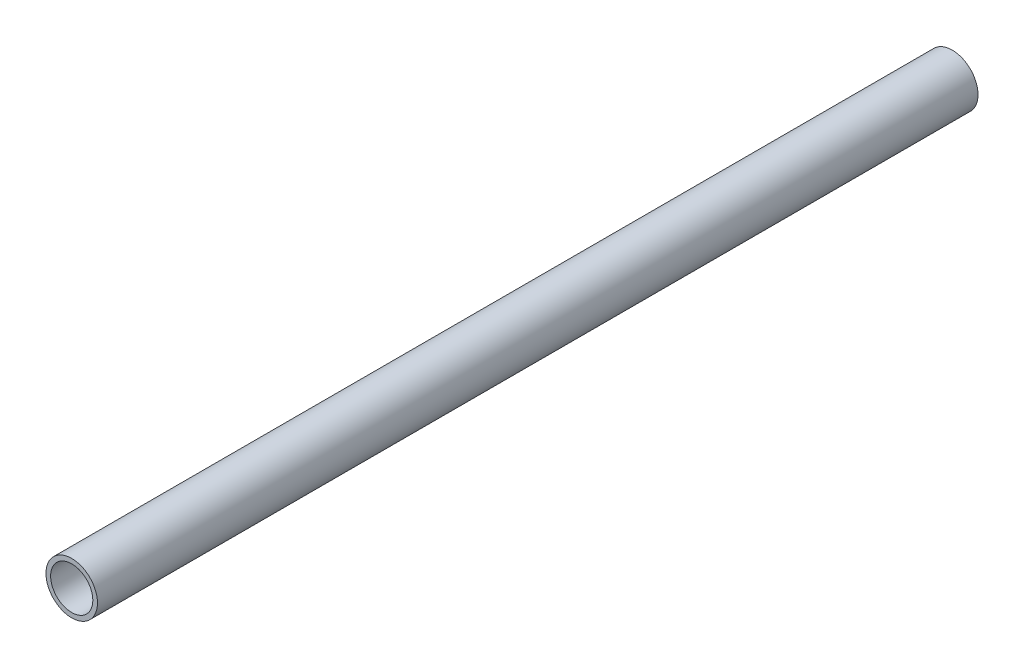
ISO-10303-21;
HEADER;
FILE_DESCRIPTION(('STEP AP214'),'2;1');
FILE_NAME('part.step','',(''),(''),'','','');
FILE_SCHEMA(('AUTOMOTIVE_DESIGN { 1 0 10303 214 1 1 1 1 }'));
ENDSEC;
DATA;
#1=APPLICATION_CONTEXT('core data for automotive mechanical design processes');
#2=APPLICATION_PROTOCOL_DEFINITION('international standard','automotive_design',2000,#1);
#3=PRODUCT_CONTEXT('',#1,'mechanical');
#4=PRODUCT('Part','Part','',(#3));
#5=PRODUCT_RELATED_PRODUCT_CATEGORY('part','',(#4));
#6=PRODUCT_DEFINITION_FORMATION('','',#4);
#7=PRODUCT_DEFINITION_CONTEXT('part definition',#1,'design');
#8=PRODUCT_DEFINITION('design','',#6,#7);
#9=PRODUCT_DEFINITION_SHAPE('','',#8);
#10=(LENGTH_UNIT() NAMED_UNIT(*) SI_UNIT(.MILLI.,.METRE.));
#11=(NAMED_UNIT(*) PLANE_ANGLE_UNIT() SI_UNIT($,.RADIAN.));
#12=(NAMED_UNIT(*) SI_UNIT($,.STERADIAN.) SOLID_ANGLE_UNIT());
#13=UNCERTAINTY_MEASURE_WITH_UNIT(LENGTH_MEASURE(1.E-05),#10,'distance_accuracy_value','');
#14=(GEOMETRIC_REPRESENTATION_CONTEXT(3) GLOBAL_UNCERTAINTY_ASSIGNED_CONTEXT((#13)) GLOBAL_UNIT_ASSIGNED_CONTEXT((#10,
#11,#12)) REPRESENTATION_CONTEXT('',''));
#15=CARTESIAN_POINT('',(0.,0.,0.));
#16=DIRECTION('',(0.,0.,1.));
#17=DIRECTION('',(1.,0.,0.));
#18=AXIS2_PLACEMENT_3D('',#15,#16,#17);
#19=CARTESIAN_POINT('',(0.,0.,-45.2043070672369));
#20=DIRECTION('',(0.,0.,1.));
#21=DIRECTION('',(1.,0.,0.));
#22=AXIS2_PLACEMENT_3D('',#19,#20,#21);
#23=CYLINDRICAL_SURFACE('',#22,7.75);
#24=CARTESIAN_POINT('',(0.,0.,-45.2043070672369));
#25=DIRECTION('',(0.,0.,1.));
#26=DIRECTION('',(1.,0.,0.));
#27=AXIS2_PLACEMENT_3D('',#24,#25,#26);
#28=CIRCLE('',#27,7.75);
#29=CARTESIAN_POINT('',(7.75,0.,-45.2043070672369));
#30=VERTEX_POINT('',#29);
#31=EDGE_CURVE('E10',#30,#30,#28,.T.);
#32=ORIENTED_EDGE('',*,*,#31,.T.);
#33=EDGE_LOOP('',(#32));
#34=FACE_BOUND('',#33,.T.);
#35=CARTESIAN_POINT('',(0.,0.,219.716847890713));
#36=DIRECTION('',(0.,0.,1.));
#37=DIRECTION('',(1.,0.,0.));
#38=AXIS2_PLACEMENT_3D('',#35,#36,#37);
#39=CIRCLE('',#38,7.75);
#40=CARTESIAN_POINT('',(7.75,0.,219.716847890713));
#41=VERTEX_POINT('',#40);
#42=EDGE_CURVE('E42',#41,#41,#39,.T.);
#43=ORIENTED_EDGE('',*,*,#42,.F.);
#44=EDGE_LOOP('',(#43));
#45=FACE_BOUND('',#44,.T.);
#46=ADVANCED_FACE('F32',(#34,#45),#23,.T.);
#47=CARTESIAN_POINT('',(0.,0.,-45.2043070672369));
#48=DIRECTION('',(0.,0.,1.));
#49=DIRECTION('',(1.,0.,0.));
#50=AXIS2_PLACEMENT_3D('',#47,#48,#49);
#51=PLANE('',#50);
#52=CARTESIAN_POINT('',(0.,0.,-45.2043070672369));
#53=DIRECTION('',(0.,0.,1.));
#54=DIRECTION('',(1.,0.,0.));
#55=AXIS2_PLACEMENT_3D('',#52,#53,#54);
#56=CIRCLE('',#55,6.35);
#57=CARTESIAN_POINT('',(6.35,0.,-45.2043070672369));
#58=VERTEX_POINT('',#57);
#59=EDGE_CURVE('E38',#58,#58,#56,.T.);
#60=ORIENTED_EDGE('',*,*,#59,.T.);
#61=EDGE_LOOP('',(#60));
#62=FACE_BOUND('',#61,.T.);
#63=ORIENTED_EDGE('',*,*,#31,.F.);
#64=EDGE_LOOP('',(#63));
#65=FACE_BOUND('',#64,.T.);
#66=ADVANCED_FACE('F61',(#62,#65),#51,.F.);
#67=CARTESIAN_POINT('',(0.,0.,-45.2043070672369));
#68=DIRECTION('',(0.,0.,1.));
#69=DIRECTION('',(1.,0.,0.));
#70=AXIS2_PLACEMENT_3D('',#67,#68,#69);
#71=CYLINDRICAL_SURFACE('',#70,6.35);
#72=ORIENTED_EDGE('',*,*,#59,.F.);
#73=EDGE_LOOP('',(#72));
#74=FACE_BOUND('',#73,.T.);
#75=CARTESIAN_POINT('',(0.,0.,219.716847890713));
#76=DIRECTION('',(0.,0.,1.));
#77=DIRECTION('',(1.,0.,0.));
#78=AXIS2_PLACEMENT_3D('',#75,#76,#77);
#79=CIRCLE('',#78,6.35);
#80=CARTESIAN_POINT('',(6.35,0.,219.716847890713));
#81=VERTEX_POINT('',#80);
#82=EDGE_CURVE('E46',#81,#81,#79,.T.);
#83=ORIENTED_EDGE('',*,*,#82,.T.);
#84=EDGE_LOOP('',(#83));
#85=FACE_BOUND('',#84,.T.);
#86=ADVANCED_FACE('F52',(#74,#85),#71,.F.);
#87=CARTESIAN_POINT('',(0.,0.,219.716847890713));
#88=DIRECTION('',(0.,0.,1.));
#89=DIRECTION('',(1.,0.,0.));
#90=AXIS2_PLACEMENT_3D('',#87,#88,#89);
#91=PLANE('',#90);
#92=ORIENTED_EDGE('',*,*,#42,.T.);
#93=EDGE_LOOP('',(#92));
#94=FACE_BOUND('',#93,.T.);
#95=ORIENTED_EDGE('',*,*,#82,.F.);
#96=EDGE_LOOP('',(#95));
#97=FACE_BOUND('',#96,.T.);
#98=ADVANCED_FACE('F54',(#94,#97),#91,.T.);
#99=CLOSED_SHELL('',(#46,#66,#86,#98));
#100=MANIFOLD_SOLID_BREP('B2',#99);
#101=ADVANCED_BREP_SHAPE_REPRESENTATION('',(#18,#100),#14);
#102=SHAPE_DEFINITION_REPRESENTATION(#9,#101);
ENDSEC;
END-ISO-10303-21;
